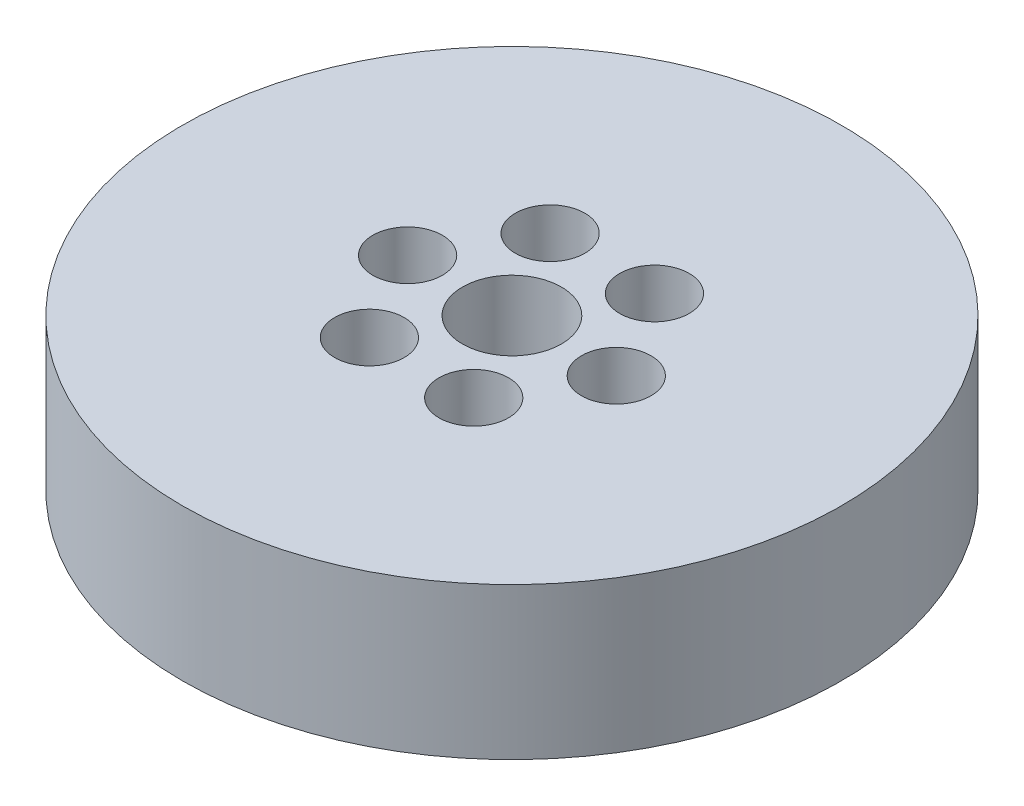
ISO-10303-21;
HEADER;
FILE_DESCRIPTION(('STEP AP214'),'2;1');
FILE_NAME('part.step','',(''),(''),'','','');
FILE_SCHEMA(('AUTOMOTIVE_DESIGN { 1 0 10303 214 1 1 1 1 }'));
ENDSEC;
DATA;
#1=APPLICATION_CONTEXT('core data for automotive mechanical design processes');
#2=APPLICATION_PROTOCOL_DEFINITION('international standard','automotive_design',2000,#1);
#3=PRODUCT_CONTEXT('',#1,'mechanical');
#4=PRODUCT('Part','Part','',(#3));
#5=PRODUCT_RELATED_PRODUCT_CATEGORY('part','',(#4));
#6=PRODUCT_DEFINITION_FORMATION('','',#4);
#7=PRODUCT_DEFINITION_CONTEXT('part definition',#1,'design');
#8=PRODUCT_DEFINITION('design','',#6,#7);
#9=PRODUCT_DEFINITION_SHAPE('','',#8);
#10=(LENGTH_UNIT() NAMED_UNIT(*) SI_UNIT(.MILLI.,.METRE.));
#11=(NAMED_UNIT(*) PLANE_ANGLE_UNIT() SI_UNIT($,.RADIAN.));
#12=(NAMED_UNIT(*) SI_UNIT($,.STERADIAN.) SOLID_ANGLE_UNIT());
#13=UNCERTAINTY_MEASURE_WITH_UNIT(LENGTH_MEASURE(1.E-05),#10,'distance_accuracy_value','');
#14=(GEOMETRIC_REPRESENTATION_CONTEXT(3) GLOBAL_UNCERTAINTY_ASSIGNED_CONTEXT((#13)) GLOBAL_UNIT_ASSIGNED_CONTEXT((#10,
#11,#12)) REPRESENTATION_CONTEXT('',''));
#15=CARTESIAN_POINT('',(0.,0.,0.));
#16=DIRECTION('',(0.,0.,1.));
#17=DIRECTION('',(1.,0.,0.));
#18=AXIS2_PLACEMENT_3D('',#15,#16,#17);
#19=CARTESIAN_POINT('',(0.,23.,0.));
#20=DIRECTION('',(0.,-1.,0.));
#21=DIRECTION('',(0.,0.,-1.));
#22=AXIS2_PLACEMENT_3D('',#19,#20,#21);
#23=CYLINDRICAL_SURFACE('',#22,50.);
#24=CARTESIAN_POINT('',(0.,23.,0.));
#25=DIRECTION('',(0.,1.,0.));
#26=DIRECTION('',(0.,0.,1.));
#27=AXIS2_PLACEMENT_3D('',#24,#25,#26);
#28=CIRCLE('',#27,50.);
#29=CARTESIAN_POINT('',(0.,23.,50.));
#30=VERTEX_POINT('',#29);
#31=EDGE_CURVE('E10',#30,#30,#28,.T.);
#32=ORIENTED_EDGE('',*,*,#31,.F.);
#33=EDGE_LOOP('',(#32));
#34=FACE_BOUND('',#33,.T.);
#35=CARTESIAN_POINT('',(0.,0.,0.));
#36=DIRECTION('',(0.,1.,0.));
#37=DIRECTION('',(0.,0.,1.));
#38=AXIS2_PLACEMENT_3D('',#35,#36,#37);
#39=CIRCLE('',#38,50.);
#40=CARTESIAN_POINT('',(0.,0.,50.));
#41=VERTEX_POINT('',#40);
#42=EDGE_CURVE('E37',#41,#41,#39,.T.);
#43=ORIENTED_EDGE('',*,*,#42,.T.);
#44=EDGE_LOOP('',(#43));
#45=FACE_BOUND('',#44,.T.);
#46=ADVANCED_FACE('F40',(#34,#45),#23,.T.);
#47=CARTESIAN_POINT('',(0.,23.,0.));
#48=DIRECTION('',(0.,1.,0.));
#49=DIRECTION('',(0.,0.,1.));
#50=AXIS2_PLACEMENT_3D('',#47,#48,#49);
#51=PLANE('',#50);
#52=CARTESIAN_POINT('',(-7.91424742972884,23.,-13.7078786519614));
#53=DIRECTION('',(0.,1.,0.));
#54=DIRECTION('',(-0.866025403784433,0.,0.50000000000001));
#55=AXIS2_PLACEMENT_3D('',#52,#53,#54);
#56=CIRCLE('',#55,5.27369622288344);
#57=CARTESIAN_POINT('',(-12.4814023305879,23.,-11.0710305405196));
#58=VERTEX_POINT('',#57);
#59=EDGE_CURVE('E70',#58,#58,#56,.T.);
#60=ORIENTED_EDGE('',*,*,#59,.F.);
#61=EDGE_LOOP('',(#60));
#62=FACE_BOUND('',#61,.T.);
#63=CARTESIAN_POINT('',(7.91424742972855,23.,-13.7078786519615));
#64=DIRECTION('',(0.,1.,0.));
#65=DIRECTION('',(-0.866025403784443,0.,-0.499999999999992));
#66=AXIS2_PLACEMENT_3D('',#63,#64,#65);
#67=CIRCLE('',#66,5.27369622288344);
#68=CARTESIAN_POINT('',(3.34709252886943,23.,-16.3447267634032));
#69=VERTEX_POINT('',#68);
#70=EDGE_CURVE('E71',#69,#69,#67,.T.);
#71=ORIENTED_EDGE('',*,*,#70,.F.);
#72=EDGE_LOOP('',(#71));
#73=FACE_BOUND('',#72,.T.);
#74=CARTESIAN_POINT('',(15.8284948594574,23.,0.));
#75=DIRECTION('',(0.,1.,0.));
#76=DIRECTION('',(0.,0.,-1.));
#77=AXIS2_PLACEMENT_3D('',#74,#75,#76);
#78=CIRCLE('',#77,5.27369622288344);
#79=CARTESIAN_POINT('',(15.8284948594574,23.,-5.27369622288344));
#80=VERTEX_POINT('',#79);
#81=EDGE_CURVE('E78',#80,#80,#78,.T.);
#82=ORIENTED_EDGE('',*,*,#81,.F.);
#83=EDGE_LOOP('',(#82));
#84=FACE_BOUND('',#83,.T.);
#85=CARTESIAN_POINT('',(7.91424742972874,23.,13.7078786519614));
#86=DIRECTION('',(0.,1.,0.));
#87=DIRECTION('',(0.866025403784436,0.,-0.500000000000004));
#88=AXIS2_PLACEMENT_3D('',#85,#86,#87);
#89=CIRCLE('',#88,5.27369622288344);
#90=CARTESIAN_POINT('',(12.4814023305878,23.,11.0710305405197));
#91=VERTEX_POINT('',#90);
#92=EDGE_CURVE('E84',#91,#91,#89,.T.);
#93=ORIENTED_EDGE('',*,*,#92,.F.);
#94=EDGE_LOOP('',(#93));
#95=FACE_BOUND('',#94,.T.);
#96=CARTESIAN_POINT('',(-7.91424742972865,23.,13.7078786519615));
#97=DIRECTION('',(0.,1.,0.));
#98=DIRECTION('',(0.86602540378444,0.,0.499999999999998));
#99=AXIS2_PLACEMENT_3D('',#96,#97,#98);
#100=CIRCLE('',#99,5.27369622288344);
#101=CARTESIAN_POINT('',(-3.34709252886954,23.,16.3447267634032));
#102=VERTEX_POINT('',#101);
#103=EDGE_CURVE('E61',#102,#102,#100,.T.);
#104=ORIENTED_EDGE('',*,*,#103,.F.);
#105=EDGE_LOOP('',(#104));
#106=FACE_BOUND('',#105,.T.);
#107=CARTESIAN_POINT('',(-15.8284948594574,23.,0.));
#108=DIRECTION('',(0.,1.,0.));
#109=DIRECTION('',(0.,0.,1.));
#110=AXIS2_PLACEMENT_3D('',#107,#108,#109);
#111=CIRCLE('',#110,5.27369622288344);
#112=CARTESIAN_POINT('',(-15.8284948594574,23.,5.27369622288344));
#113=VERTEX_POINT('',#112);
#114=EDGE_CURVE('E54',#113,#113,#111,.T.);
#115=ORIENTED_EDGE('',*,*,#114,.F.);
#116=EDGE_LOOP('',(#115));
#117=FACE_BOUND('',#116,.T.);
#118=CARTESIAN_POINT('',(0.,23.,0.));
#119=DIRECTION('',(0.,1.,0.));
#120=DIRECTION('',(0.,0.,1.));
#121=AXIS2_PLACEMENT_3D('',#118,#119,#120);
#122=CIRCLE('',#121,7.5);
#123=CARTESIAN_POINT('',(0.,23.,7.5));
#124=VERTEX_POINT('',#123);
#125=EDGE_CURVE('E50',#124,#124,#122,.T.);
#126=ORIENTED_EDGE('',*,*,#125,.F.);
#127=EDGE_LOOP('',(#126));
#128=FACE_BOUND('',#127,.T.);
#129=ORIENTED_EDGE('',*,*,#31,.T.);
#130=EDGE_LOOP('',(#129));
#131=FACE_BOUND('',#130,.T.);
#132=ADVANCED_FACE('F99',(#62,#73,#84,#95,#106,#117,#128,#131),#51,.T.);
#133=CARTESIAN_POINT('',(0.,0.,0.));
#134=DIRECTION('',(0.,1.,0.));
#135=DIRECTION('',(0.,0.,1.));
#136=AXIS2_PLACEMENT_3D('',#133,#134,#135);
#137=PLANE('',#136);
#138=CARTESIAN_POINT('',(0.,0.,0.));
#139=DIRECTION('',(0.,1.,0.));
#140=DIRECTION('',(0.,0.,1.));
#141=AXIS2_PLACEMENT_3D('',#138,#139,#140);
#142=CIRCLE('',#141,7.5);
#143=CARTESIAN_POINT('',(0.,0.,7.5));
#144=VERTEX_POINT('',#143);
#145=EDGE_CURVE('E47',#144,#144,#142,.T.);
#146=ORIENTED_EDGE('',*,*,#145,.T.);
#147=EDGE_LOOP('',(#146));
#148=FACE_BOUND('',#147,.T.);
#149=ORIENTED_EDGE('',*,*,#42,.F.);
#150=EDGE_LOOP('',(#149));
#151=FACE_BOUND('',#150,.T.);
#152=ADVANCED_FACE('F103',(#148,#151),#137,.F.);
#153=CARTESIAN_POINT('',(0.,23.,0.));
#154=DIRECTION('',(0.,-1.,0.));
#155=DIRECTION('',(0.,0.,-1.));
#156=AXIS2_PLACEMENT_3D('',#153,#154,#155);
#157=CYLINDRICAL_SURFACE('',#156,7.5);
#158=ORIENTED_EDGE('',*,*,#125,.T.);
#159=EDGE_LOOP('',(#158));
#160=FACE_BOUND('',#159,.T.);
#161=ORIENTED_EDGE('',*,*,#145,.F.);
#162=EDGE_LOOP('',(#161));
#163=FACE_BOUND('',#162,.T.);
#164=ADVANCED_FACE('F115',(#160,#163),#157,.F.);
#165=CARTESIAN_POINT('',(-15.8284948594574,0.793911206499728,0.));
#166=DIRECTION('',(0.,1.,0.));
#167=DIRECTION('',(0.,0.,1.));
#168=AXIS2_PLACEMENT_3D('',#165,#166,#167);
#169=CYLINDRICAL_SURFACE('',#168,5.27369622288344);
#170=CARTESIAN_POINT('',(-15.8284948594574,0.793911206499728,0.));
#171=DIRECTION('',(0.,1.,0.));
#172=DIRECTION('',(0.,0.,1.));
#173=AXIS2_PLACEMENT_3D('',#170,#171,#172);
#174=CIRCLE('',#173,5.27369622288344);
#175=CARTESIAN_POINT('',(-15.8284948594574,0.793911206499728,5.27369622288344));
#176=VERTEX_POINT('',#175);
#177=EDGE_CURVE('E55',#176,#176,#174,.T.);
#178=ORIENTED_EDGE('',*,*,#177,.F.);
#179=EDGE_LOOP('',(#178));
#180=FACE_BOUND('',#179,.T.);
#181=ORIENTED_EDGE('',*,*,#114,.T.);
#182=EDGE_LOOP('',(#181));
#183=FACE_BOUND('',#182,.T.);
#184=ADVANCED_FACE('F113',(#180,#183),#169,.F.);
#185=CARTESIAN_POINT('',(-15.8284948594574,0.793911206499728,0.));
#186=DIRECTION('',(0.,1.,0.));
#187=DIRECTION('',(0.,0.,1.));
#188=AXIS2_PLACEMENT_3D('',#185,#186,#187);
#189=PLANE('',#188);
#190=ORIENTED_EDGE('',*,*,#177,.T.);
#191=EDGE_LOOP('',(#190));
#192=FACE_BOUND('',#191,.T.);
#193=ADVANCED_FACE('F144',(#192),#189,.T.);
#194=CARTESIAN_POINT('',(-7.91424742972865,0.793911206499728,13.7078786519615));
#195=DIRECTION('',(0.,1.,0.));
#196=DIRECTION('',(0.,0.,1.));
#197=AXIS2_PLACEMENT_3D('',#194,#195,#196);
#198=CYLINDRICAL_SURFACE('',#197,5.27369622288344);
#199=CARTESIAN_POINT('',(-7.91424742972865,0.793911206499728,13.7078786519615));
#200=DIRECTION('',(0.,1.,0.));
#201=DIRECTION('',(0.86602540378444,0.,0.499999999999998));
#202=AXIS2_PLACEMENT_3D('',#199,#200,#201);
#203=CIRCLE('',#202,5.27369622288344);
#204=CARTESIAN_POINT('',(-3.34709252886954,0.793911206499728,16.3447267634032));
#205=VERTEX_POINT('',#204);
#206=EDGE_CURVE('E59',#205,#205,#203,.T.);
#207=ORIENTED_EDGE('',*,*,#206,.F.);
#208=EDGE_LOOP('',(#207));
#209=FACE_BOUND('',#208,.T.);
#210=ORIENTED_EDGE('',*,*,#103,.T.);
#211=EDGE_LOOP('',(#210));
#212=FACE_BOUND('',#211,.T.);
#213=ADVANCED_FACE('F153',(#209,#212),#198,.F.);
#214=CARTESIAN_POINT('',(-7.91424742972865,0.793911206499728,13.7078786519615));
#215=DIRECTION('',(0.,1.,0.));
#216=DIRECTION('',(0.86602540378444,0.,0.499999999999998));
#217=AXIS2_PLACEMENT_3D('',#214,#215,#216);
#218=PLANE('',#217);
#219=ORIENTED_EDGE('',*,*,#206,.T.);
#220=EDGE_LOOP('',(#219));
#221=FACE_BOUND('',#220,.T.);
#222=ADVANCED_FACE('F96',(#221),#218,.T.);
#223=CARTESIAN_POINT('',(7.91424742972874,0.793911206499728,13.7078786519614));
#224=DIRECTION('',(0.,1.,0.));
#225=DIRECTION('',(0.,0.,1.));
#226=AXIS2_PLACEMENT_3D('',#223,#224,#225);
#227=CYLINDRICAL_SURFACE('',#226,5.27369622288344);
#228=CARTESIAN_POINT('',(7.91424742972874,0.793911206499728,13.7078786519614));
#229=DIRECTION('',(0.,1.,0.));
#230=DIRECTION('',(0.866025403784436,0.,-0.500000000000004));
#231=AXIS2_PLACEMENT_3D('',#228,#229,#230);
#232=CIRCLE('',#231,5.27369622288344);
#233=CARTESIAN_POINT('',(12.4814023305878,0.793911206499728,11.0710305405197));
#234=VERTEX_POINT('',#233);
#235=EDGE_CURVE('E63',#234,#234,#232,.T.);
#236=ORIENTED_EDGE('',*,*,#235,.F.);
#237=EDGE_LOOP('',(#236));
#238=FACE_BOUND('',#237,.T.);
#239=ORIENTED_EDGE('',*,*,#92,.T.);
#240=EDGE_LOOP('',(#239));
#241=FACE_BOUND('',#240,.T.);
#242=ADVANCED_FACE('F91',(#238,#241),#227,.F.);
#243=CARTESIAN_POINT('',(7.91424742972874,0.793911206499728,13.7078786519614));
#244=DIRECTION('',(0.,1.,0.));
#245=DIRECTION('',(0.866025403784436,0.,-0.500000000000004));
#246=AXIS2_PLACEMENT_3D('',#243,#244,#245);
#247=PLANE('',#246);
#248=ORIENTED_EDGE('',*,*,#235,.T.);
#249=EDGE_LOOP('',(#248));
#250=FACE_BOUND('',#249,.T.);
#251=ADVANCED_FACE('F93',(#250),#247,.T.);
#252=CARTESIAN_POINT('',(15.8284948594574,0.793911206499728,0.));
#253=DIRECTION('',(0.,1.,0.));
#254=DIRECTION('',(0.,0.,1.));
#255=AXIS2_PLACEMENT_3D('',#252,#253,#254);
#256=CYLINDRICAL_SURFACE('',#255,5.27369622288344);
#257=CARTESIAN_POINT('',(15.8284948594574,0.793911206499728,0.));
#258=DIRECTION('',(0.,1.,0.));
#259=DIRECTION('',(0.,0.,-1.));
#260=AXIS2_PLACEMENT_3D('',#257,#258,#259);
#261=CIRCLE('',#260,5.27369622288344);
#262=CARTESIAN_POINT('',(15.8284948594574,0.793911206499728,-5.27369622288344));
#263=VERTEX_POINT('',#262);
#264=EDGE_CURVE('E85',#263,#263,#261,.T.);
#265=ORIENTED_EDGE('',*,*,#264,.F.);
#266=EDGE_LOOP('',(#265));
#267=FACE_BOUND('',#266,.T.);
#268=ORIENTED_EDGE('',*,*,#81,.T.);
#269=EDGE_LOOP('',(#268));
#270=FACE_BOUND('',#269,.T.);
#271=ADVANCED_FACE('F187',(#267,#270),#256,.F.);
#272=CARTESIAN_POINT('',(15.8284948594574,0.793911206499728,0.));
#273=DIRECTION('',(0.,1.,0.));
#274=DIRECTION('',(0.,0.,-1.));
#275=AXIS2_PLACEMENT_3D('',#272,#273,#274);
#276=PLANE('',#275);
#277=ORIENTED_EDGE('',*,*,#264,.T.);
#278=EDGE_LOOP('',(#277));
#279=FACE_BOUND('',#278,.T.);
#280=ADVANCED_FACE('F198',(#279),#276,.T.);
#281=CARTESIAN_POINT('',(7.91424742972855,0.793911206499728,-13.7078786519615));
#282=DIRECTION('',(0.,1.,0.));
#283=DIRECTION('',(0.,0.,1.));
#284=AXIS2_PLACEMENT_3D('',#281,#282,#283);
#285=CYLINDRICAL_SURFACE('',#284,5.27369622288344);
#286=CARTESIAN_POINT('',(7.91424742972855,0.793911206499728,-13.7078786519615));
#287=DIRECTION('',(0.,1.,0.));
#288=DIRECTION('',(-0.866025403784443,0.,-0.499999999999992));
#289=AXIS2_PLACEMENT_3D('',#286,#287,#288);
#290=CIRCLE('',#289,5.27369622288344);
#291=CARTESIAN_POINT('',(3.34709252886943,0.793911206499728,-16.3447267634032));
#292=VERTEX_POINT('',#291);
#293=EDGE_CURVE('E76',#292,#292,#290,.T.);
#294=ORIENTED_EDGE('',*,*,#293,.F.);
#295=EDGE_LOOP('',(#294));
#296=FACE_BOUND('',#295,.T.);
#297=ORIENTED_EDGE('',*,*,#70,.T.);
#298=EDGE_LOOP('',(#297));
#299=FACE_BOUND('',#298,.T.);
#300=ADVANCED_FACE('F202',(#296,#299),#285,.F.);
#301=CARTESIAN_POINT('',(7.91424742972855,0.793911206499728,-13.7078786519615));
#302=DIRECTION('',(0.,1.,0.));
#303=DIRECTION('',(-0.866025403784443,0.,-0.499999999999992));
#304=AXIS2_PLACEMENT_3D('',#301,#302,#303);
#305=PLANE('',#304);
#306=ORIENTED_EDGE('',*,*,#293,.T.);
#307=EDGE_LOOP('',(#306));
#308=FACE_BOUND('',#307,.T.);
#309=ADVANCED_FACE('F212',(#308),#305,.T.);
#310=CARTESIAN_POINT('',(-7.91424742972884,0.793911206499728,-13.7078786519614));
#311=DIRECTION('',(0.,1.,0.));
#312=DIRECTION('',(0.,0.,1.));
#313=AXIS2_PLACEMENT_3D('',#310,#311,#312);
#314=CYLINDRICAL_SURFACE('',#313,5.27369622288344);
#315=CARTESIAN_POINT('',(-7.91424742972884,0.793911206499728,-13.7078786519614));
#316=DIRECTION('',(0.,1.,0.));
#317=DIRECTION('',(-0.866025403784433,0.,0.50000000000001));
#318=AXIS2_PLACEMENT_3D('',#315,#316,#317);
#319=CIRCLE('',#318,5.27369622288344);
#320=CARTESIAN_POINT('',(-12.4814023305879,0.793911206499728,-11.0710305405196));
#321=VERTEX_POINT('',#320);
#322=EDGE_CURVE('E69',#321,#321,#319,.T.);
#323=ORIENTED_EDGE('',*,*,#322,.F.);
#324=EDGE_LOOP('',(#323));
#325=FACE_BOUND('',#324,.T.);
#326=ORIENTED_EDGE('',*,*,#59,.T.);
#327=EDGE_LOOP('',(#326));
#328=FACE_BOUND('',#327,.T.);
#329=ADVANCED_FACE('F224',(#325,#328),#314,.F.);
#330=CARTESIAN_POINT('',(-7.91424742972884,0.793911206499728,-13.7078786519614));
#331=DIRECTION('',(0.,1.,0.));
#332=DIRECTION('',(-0.866025403784433,0.,0.50000000000001));
#333=AXIS2_PLACEMENT_3D('',#330,#331,#332);
#334=PLANE('',#333);
#335=ORIENTED_EDGE('',*,*,#322,.T.);
#336=EDGE_LOOP('',(#335));
#337=FACE_BOUND('',#336,.T.);
#338=ADVANCED_FACE('F235',(#337),#334,.T.);
#339=CLOSED_SHELL('',(#46,#132,#152,#164,#184,#193,#213,#222,#242,#251,#271,#280,#300,#309,#329,#338));
#340=MANIFOLD_SOLID_BREP('B2',#339);
#341=ADVANCED_BREP_SHAPE_REPRESENTATION('',(#18,#340),#14);
#342=SHAPE_DEFINITION_REPRESENTATION(#9,#341);
ENDSEC;
END-ISO-10303-21;
